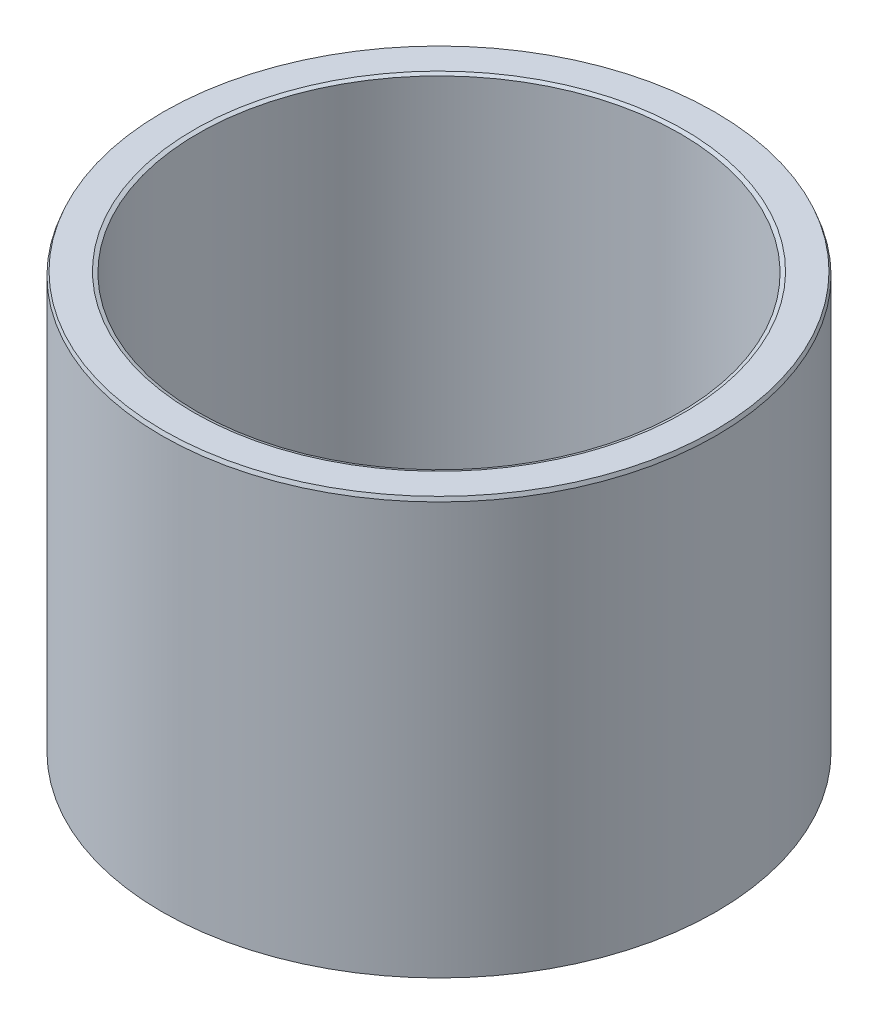
ISO-10303-21;
HEADER;
FILE_DESCRIPTION(('STEP AP214'),'2;1');
FILE_NAME('part.step','',(''),(''),'','','');
FILE_SCHEMA(('AUTOMOTIVE_DESIGN { 1 0 10303 214 1 1 1 1 }'));
ENDSEC;
DATA;
#1=APPLICATION_CONTEXT('core data for automotive mechanical design processes');
#2=APPLICATION_PROTOCOL_DEFINITION('international standard','automotive_design',2000,#1);
#3=PRODUCT_CONTEXT('',#1,'mechanical');
#4=PRODUCT('Part','Part','',(#3));
#5=PRODUCT_RELATED_PRODUCT_CATEGORY('part','',(#4));
#6=PRODUCT_DEFINITION_FORMATION('','',#4);
#7=PRODUCT_DEFINITION_CONTEXT('part definition',#1,'design');
#8=PRODUCT_DEFINITION('design','',#6,#7);
#9=PRODUCT_DEFINITION_SHAPE('','',#8);
#10=(LENGTH_UNIT() NAMED_UNIT(*) SI_UNIT(.MILLI.,.METRE.));
#11=(NAMED_UNIT(*) PLANE_ANGLE_UNIT() SI_UNIT($,.RADIAN.));
#12=(NAMED_UNIT(*) SI_UNIT($,.STERADIAN.) SOLID_ANGLE_UNIT());
#13=UNCERTAINTY_MEASURE_WITH_UNIT(LENGTH_MEASURE(1.E-05),#10,'distance_accuracy_value','');
#14=(GEOMETRIC_REPRESENTATION_CONTEXT(3) GLOBAL_UNCERTAINTY_ASSIGNED_CONTEXT((#13)) GLOBAL_UNIT_ASSIGNED_CONTEXT((#10,
#11,#12)) REPRESENTATION_CONTEXT('',''));
#15=CARTESIAN_POINT('',(0.,0.,0.));
#16=DIRECTION('',(0.,0.,1.));
#17=DIRECTION('',(1.,0.,0.));
#18=AXIS2_PLACEMENT_3D('',#15,#16,#17);
#19=CARTESIAN_POINT('',(0.,71.5364027349167,0.));
#20=DIRECTION('',(0.,-1.,0.));
#21=DIRECTION('',(0.,0.,-1.));
#22=AXIS2_PLACEMENT_3D('',#19,#20,#21);
#23=CYLINDRICAL_SURFACE('',#22,47.5);
#24=CARTESIAN_POINT('',(0.,0.250094078465463,0.));
#25=DIRECTION('',(0.,1.,0.));
#26=DIRECTION('',(0.,0.,1.));
#27=AXIS2_PLACEMENT_3D('',#24,#25,#26);
#28=CIRCLE('',#27,47.5);
#29=CARTESIAN_POINT('',(0.,0.250094078465463,47.5));
#30=VERTEX_POINT('',#29);
#31=EDGE_CURVE('E10',#30,#30,#28,.T.);
#32=ORIENTED_EDGE('',*,*,#31,.T.);
#33=EDGE_LOOP('',(#32));
#34=FACE_BOUND('',#33,.T.);
#35=CARTESIAN_POINT('',(0.,70.8761217117559,0.));
#36=DIRECTION('',(0.,1.,0.));
#37=DIRECTION('',(0.,0.,1.));
#38=AXIS2_PLACEMENT_3D('',#35,#36,#37);
#39=CIRCLE('',#38,47.5);
#40=CARTESIAN_POINT('',(0.,70.8761217117559,47.5));
#41=VERTEX_POINT('',#40);
#42=EDGE_CURVE('E50',#41,#41,#39,.F.);
#43=ORIENTED_EDGE('',*,*,#42,.T.);
#44=EDGE_LOOP('',(#43));
#45=FACE_BOUND('',#44,.T.);
#46=ADVANCED_FACE('F39',(#34,#45),#23,.T.);
#47=CARTESIAN_POINT('',(0.,71.5364027349167,0.));
#48=DIRECTION('',(0.,1.,0.));
#49=DIRECTION('',(0.,0.,1.));
#50=AXIS2_PLACEMENT_3D('',#47,#48,#49);
#51=PLANE('',#50);
#52=CARTESIAN_POINT('',(0.,71.5364027349167,0.));
#53=DIRECTION('',(0.,1.,0.));
#54=DIRECTION('',(0.,0.,1.));
#55=AXIS2_PLACEMENT_3D('',#52,#53,#54);
#56=CIRCLE('',#55,41.9864599855821);
#57=CARTESIAN_POINT('',(0.,71.5364027349167,41.9864599855821));
#58=VERTEX_POINT('',#57);
#59=EDGE_CURVE('E58',#58,#58,#56,.F.);
#60=ORIENTED_EDGE('',*,*,#59,.T.);
#61=EDGE_LOOP('',(#60));
#62=FACE_BOUND('',#61,.T.);
#63=CARTESIAN_POINT('',(0.,71.5364027349167,0.));
#64=DIRECTION('',(0.,1.,0.));
#65=DIRECTION('',(0.,0.,1.));
#66=AXIS2_PLACEMENT_3D('',#63,#64,#65);
#67=CIRCLE('',#66,47.2499059215346);
#68=CARTESIAN_POINT('',(0.,71.5364027349167,47.2499059215346));
#69=VERTEX_POINT('',#68);
#70=EDGE_CURVE('E61',#69,#69,#67,.T.);
#71=ORIENTED_EDGE('',*,*,#70,.T.);
#72=EDGE_LOOP('',(#71));
#73=FACE_BOUND('',#72,.T.);
#74=ADVANCED_FACE('F88',(#62,#73),#51,.T.);
#75=CARTESIAN_POINT('',(0.,0.,0.));
#76=DIRECTION('',(0.,1.,0.));
#77=DIRECTION('',(0.,0.,1.));
#78=AXIS2_PLACEMENT_3D('',#75,#76,#77);
#79=PLANE('',#78);
#80=CARTESIAN_POINT('',(0.,0.,0.));
#81=DIRECTION('',(0.,1.,0.));
#82=DIRECTION('',(0.,0.,1.));
#83=AXIS2_PLACEMENT_3D('',#80,#81,#82);
#84=CIRCLE('',#83,41.5762730408867);
#85=CARTESIAN_POINT('',(0.,0.,41.5762730408867));
#86=VERTEX_POINT('',#85);
#87=EDGE_CURVE('E51',#86,#86,#84,.T.);
#88=ORIENTED_EDGE('',*,*,#87,.T.);
#89=EDGE_LOOP('',(#88));
#90=FACE_BOUND('',#89,.T.);
#91=CARTESIAN_POINT('',(0.,0.,0.));
#92=DIRECTION('',(0.,1.,0.));
#93=DIRECTION('',(0.,0.,1.));
#94=AXIS2_PLACEMENT_3D('',#91,#92,#93);
#95=CIRCLE('',#94,46.8397189768391);
#96=CARTESIAN_POINT('',(0.,0.,46.8397189768391));
#97=VERTEX_POINT('',#96);
#98=EDGE_CURVE('E54',#97,#97,#95,.F.);
#99=ORIENTED_EDGE('',*,*,#98,.T.);
#100=EDGE_LOOP('',(#99));
#101=FACE_BOUND('',#100,.T.);
#102=ADVANCED_FACE('F83',(#90,#101),#79,.F.);
#103=CARTESIAN_POINT('',(0.,71.5364027349167,0.));
#104=DIRECTION('',(0.,-1.,0.));
#105=DIRECTION('',(0.,0.,-1.));
#106=AXIS2_PLACEMENT_3D('',#103,#104,#105);
#107=CYLINDRICAL_SURFACE('',#106,41.3261789624213);
#108=CARTESIAN_POINT('',(0.,71.2863086564512,0.));
#109=DIRECTION('',(0.,1.,0.));
#110=DIRECTION('',(0.,0.,1.));
#111=AXIS2_PLACEMENT_3D('',#108,#109,#110);
#112=CIRCLE('',#111,41.3261789624213);
#113=CARTESIAN_POINT('',(0.,71.2863086564512,41.3261789624213));
#114=VERTEX_POINT('',#113);
#115=EDGE_CURVE('E67',#114,#114,#112,.T.);
#116=ORIENTED_EDGE('',*,*,#115,.T.);
#117=EDGE_LOOP('',(#116));
#118=FACE_BOUND('',#117,.T.);
#119=CARTESIAN_POINT('',(0.,0.660281023160902,0.));
#120=DIRECTION('',(0.,1.,0.));
#121=DIRECTION('',(0.,0.,1.));
#122=AXIS2_PLACEMENT_3D('',#119,#120,#121);
#123=CIRCLE('',#122,41.3261789624213);
#124=CARTESIAN_POINT('',(0.,0.660281023160902,41.3261789624213));
#125=VERTEX_POINT('',#124);
#126=EDGE_CURVE('E69',#125,#125,#123,.F.);
#127=ORIENTED_EDGE('',*,*,#126,.T.);
#128=EDGE_LOOP('',(#127));
#129=FACE_BOUND('',#128,.T.);
#130=ADVANCED_FACE('F71',(#118,#129),#107,.F.);
#131=CARTESIAN_POINT('',(0.,71.2863086564512,0.));
#132=DIRECTION('',(0.,1.,0.));
#133=DIRECTION('',(0.,0.,1.));
#134=AXIS2_PLACEMENT_3D('',#131,#132,#133);
#135=CONICAL_SURFACE('',#134,41.3261789624213,1.20872530251607);
#136=ORIENTED_EDGE('',*,*,#59,.F.);
#137=EDGE_LOOP('',(#136));
#138=FACE_BOUND('',#137,.T.);
#139=ORIENTED_EDGE('',*,*,#115,.F.);
#140=EDGE_LOOP('',(#139));
#141=FACE_BOUND('',#140,.T.);
#142=ADVANCED_FACE('F77',(#138,#141),#135,.F.);
#143=CARTESIAN_POINT('',(0.,0.,0.));
#144=DIRECTION('',(0.,-1.,0.));
#145=DIRECTION('',(0.,0.,-1.));
#146=AXIS2_PLACEMENT_3D('',#143,#144,#145);
#147=CONICAL_SURFACE('',#146,41.5762730408867,0.362071024278822);
#148=ORIENTED_EDGE('',*,*,#126,.F.);
#149=EDGE_LOOP('',(#148));
#150=FACE_BOUND('',#149,.T.);
#151=ORIENTED_EDGE('',*,*,#87,.F.);
#152=EDGE_LOOP('',(#151));
#153=FACE_BOUND('',#152,.T.);
#154=ADVANCED_FACE('F73',(#150,#153),#147,.F.);
#155=CARTESIAN_POINT('',(0.,0.250094078465463,0.));
#156=DIRECTION('',(0.,1.,0.));
#157=DIRECTION('',(0.,0.,1.));
#158=AXIS2_PLACEMENT_3D('',#155,#156,#157);
#159=CONICAL_SURFACE('',#158,47.5,1.20872530251608);
#160=ORIENTED_EDGE('',*,*,#98,.F.);
#161=EDGE_LOOP('',(#160));
#162=FACE_BOUND('',#161,.T.);
#163=ORIENTED_EDGE('',*,*,#31,.F.);
#164=EDGE_LOOP('',(#163));
#165=FACE_BOUND('',#164,.T.);
#166=ADVANCED_FACE('F76',(#162,#165),#159,.T.);
#167=CARTESIAN_POINT('',(0.,71.5364027349167,0.));
#168=DIRECTION('',(0.,-1.,0.));
#169=DIRECTION('',(0.,0.,-1.));
#170=AXIS2_PLACEMENT_3D('',#167,#168,#169);
#171=CONICAL_SURFACE('',#170,47.2499059215346,0.362071024278802);
#172=ORIENTED_EDGE('',*,*,#42,.F.);
#173=EDGE_LOOP('',(#172));
#174=FACE_BOUND('',#173,.T.);
#175=ORIENTED_EDGE('',*,*,#70,.F.);
#176=EDGE_LOOP('',(#175));
#177=FACE_BOUND('',#176,.T.);
#178=ADVANCED_FACE('F45',(#174,#177),#171,.T.);
#179=CLOSED_SHELL('',(#46,#74,#102,#130,#142,#154,#166,#178));
#180=MANIFOLD_SOLID_BREP('B2',#179);
#181=ADVANCED_BREP_SHAPE_REPRESENTATION('',(#18,#180),#14);
#182=SHAPE_DEFINITION_REPRESENTATION(#9,#181);
ENDSEC;
END-ISO-10303-21;
